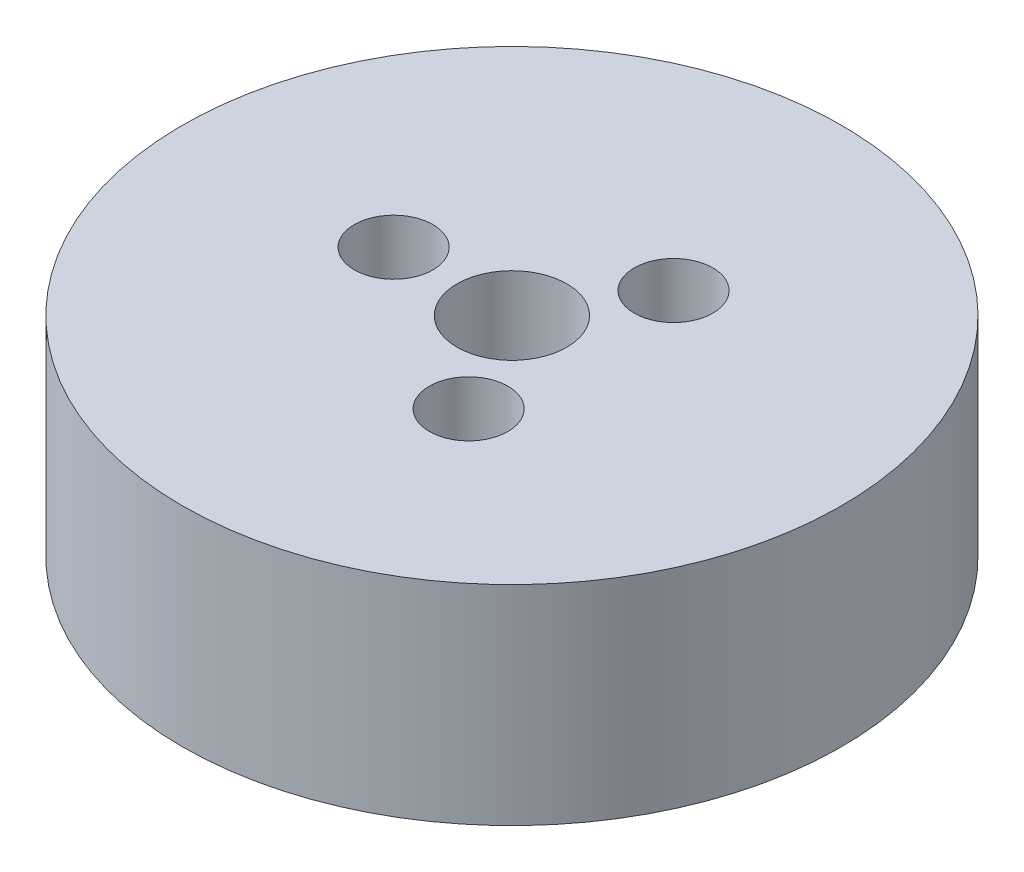
ISO-10303-21;
HEADER;
FILE_DESCRIPTION(('STEP AP214'),'2;1');
FILE_NAME('part.step','',(''),(''),'','','');
FILE_SCHEMA(('AUTOMOTIVE_DESIGN { 1 0 10303 214 1 1 1 1 }'));
ENDSEC;
DATA;
#1=APPLICATION_CONTEXT('core data for automotive mechanical design processes');
#2=APPLICATION_PROTOCOL_DEFINITION('international standard','automotive_design',2000,#1);
#3=PRODUCT_CONTEXT('',#1,'mechanical');
#4=PRODUCT('Part','Part','',(#3));
#5=PRODUCT_RELATED_PRODUCT_CATEGORY('part','',(#4));
#6=PRODUCT_DEFINITION_FORMATION('','',#4);
#7=PRODUCT_DEFINITION_CONTEXT('part definition',#1,'design');
#8=PRODUCT_DEFINITION('design','',#6,#7);
#9=PRODUCT_DEFINITION_SHAPE('','',#8);
#10=(LENGTH_UNIT() NAMED_UNIT(*) SI_UNIT(.MILLI.,.METRE.));
#11=(NAMED_UNIT(*) PLANE_ANGLE_UNIT() SI_UNIT($,.RADIAN.));
#12=(NAMED_UNIT(*) SI_UNIT($,.STERADIAN.) SOLID_ANGLE_UNIT());
#13=UNCERTAINTY_MEASURE_WITH_UNIT(LENGTH_MEASURE(1.E-05),#10,'distance_accuracy_value','');
#14=(GEOMETRIC_REPRESENTATION_CONTEXT(3) GLOBAL_UNCERTAINTY_ASSIGNED_CONTEXT((#13)) GLOBAL_UNIT_ASSIGNED_CONTEXT((#10,
#11,#12)) REPRESENTATION_CONTEXT('',''));
#15=CARTESIAN_POINT('',(0.,0.,0.));
#16=DIRECTION('',(0.,0.,1.));
#17=DIRECTION('',(1.,0.,0.));
#18=AXIS2_PLACEMENT_3D('',#15,#16,#17);
#19=CARTESIAN_POINT('',(0.,19.,0.));
#20=DIRECTION('',(0.,-1.,0.));
#21=DIRECTION('',(0.,0.,-1.));
#22=AXIS2_PLACEMENT_3D('',#19,#20,#21);
#23=CYLINDRICAL_SURFACE('',#22,30.);
#24=CARTESIAN_POINT('',(0.,19.,0.));
#25=DIRECTION('',(0.,1.,0.));
#26=DIRECTION('',(0.,0.,1.));
#27=AXIS2_PLACEMENT_3D('',#24,#25,#26);
#28=CIRCLE('',#27,30.);
#29=CARTESIAN_POINT('',(0.,19.,30.));
#30=VERTEX_POINT('',#29);
#31=EDGE_CURVE('E10',#30,#30,#28,.T.);
#32=ORIENTED_EDGE('',*,*,#31,.F.);
#33=EDGE_LOOP('',(#32));
#34=FACE_BOUND('',#33,.T.);
#35=CARTESIAN_POINT('',(0.,0.,0.));
#36=DIRECTION('',(0.,1.,0.));
#37=DIRECTION('',(0.,0.,1.));
#38=AXIS2_PLACEMENT_3D('',#35,#36,#37);
#39=CIRCLE('',#38,30.);
#40=CARTESIAN_POINT('',(0.,0.,30.));
#41=VERTEX_POINT('',#40);
#42=EDGE_CURVE('E37',#41,#41,#39,.T.);
#43=ORIENTED_EDGE('',*,*,#42,.T.);
#44=EDGE_LOOP('',(#43));
#45=FACE_BOUND('',#44,.T.);
#46=ADVANCED_FACE('F40',(#34,#45),#23,.T.);
#47=CARTESIAN_POINT('',(0.,19.,0.));
#48=DIRECTION('',(0.,1.,0.));
#49=DIRECTION('',(0.,0.,1.));
#50=AXIS2_PLACEMENT_3D('',#47,#48,#49);
#51=PLANE('',#50);
#52=CARTESIAN_POINT('',(5.38467008673534,19.,9.32652217222182));
#53=DIRECTION('',(0.,1.,0.));
#54=DIRECTION('',(0.866025403784436,0.,-0.500000000000004));
#55=AXIS2_PLACEMENT_3D('',#52,#53,#54);
#56=CIRCLE('',#55,3.57641754704199);
#57=CARTESIAN_POINT('',(8.48193853701412,19.,7.53831339870081));
#58=VERTEX_POINT('',#57);
#59=EDGE_CURVE('E70',#58,#58,#56,.T.);
#60=ORIENTED_EDGE('',*,*,#59,.F.);
#61=EDGE_LOOP('',(#60));
#62=FACE_BOUND('',#61,.T.);
#63=CARTESIAN_POINT('',(5.38467008673521,19.,-9.32652217222189));
#64=DIRECTION('',(0.,1.,0.));
#65=DIRECTION('',(-0.866025403784443,0.,-0.499999999999992));
#66=AXIS2_PLACEMENT_3D('',#63,#64,#65);
#67=CIRCLE('',#66,3.57641754704199);
#68=CARTESIAN_POINT('',(2.2874016364564,19.,-11.1147309457429));
#69=VERTEX_POINT('',#68);
#70=EDGE_CURVE('E61',#69,#69,#67,.T.);
#71=ORIENTED_EDGE('',*,*,#70,.F.);
#72=EDGE_LOOP('',(#71));
#73=FACE_BOUND('',#72,.T.);
#74=CARTESIAN_POINT('',(-10.7693401734706,19.,0.));
#75=DIRECTION('',(0.,1.,0.));
#76=DIRECTION('',(0.,0.,1.));
#77=AXIS2_PLACEMENT_3D('',#74,#75,#76);
#78=CIRCLE('',#77,3.57641754704199);
#79=CARTESIAN_POINT('',(-10.7693401734706,19.,3.57641754704199));
#80=VERTEX_POINT('',#79);
#81=EDGE_CURVE('E54',#80,#80,#78,.T.);
#82=ORIENTED_EDGE('',*,*,#81,.F.);
#83=EDGE_LOOP('',(#82));
#84=FACE_BOUND('',#83,.T.);
#85=CARTESIAN_POINT('',(0.,19.,0.));
#86=DIRECTION('',(0.,1.,0.));
#87=DIRECTION('',(0.,0.,1.));
#88=AXIS2_PLACEMENT_3D('',#85,#86,#87);
#89=CIRCLE('',#88,5.);
#90=CARTESIAN_POINT('',(0.,19.,5.));
#91=VERTEX_POINT('',#90);
#92=EDGE_CURVE('E50',#91,#91,#89,.T.);
#93=ORIENTED_EDGE('',*,*,#92,.F.);
#94=EDGE_LOOP('',(#93));
#95=FACE_BOUND('',#94,.T.);
#96=ORIENTED_EDGE('',*,*,#31,.T.);
#97=EDGE_LOOP('',(#96));
#98=FACE_BOUND('',#97,.T.);
#99=ADVANCED_FACE('F85',(#62,#73,#84,#95,#98),#51,.T.);
#100=CARTESIAN_POINT('',(0.,0.,0.));
#101=DIRECTION('',(0.,1.,0.));
#102=DIRECTION('',(0.,0.,1.));
#103=AXIS2_PLACEMENT_3D('',#100,#101,#102);
#104=PLANE('',#103);
#105=CARTESIAN_POINT('',(0.,0.,0.));
#106=DIRECTION('',(0.,1.,0.));
#107=DIRECTION('',(0.,0.,1.));
#108=AXIS2_PLACEMENT_3D('',#105,#106,#107);
#109=CIRCLE('',#108,5.);
#110=CARTESIAN_POINT('',(0.,0.,5.));
#111=VERTEX_POINT('',#110);
#112=EDGE_CURVE('E47',#111,#111,#109,.T.);
#113=ORIENTED_EDGE('',*,*,#112,.T.);
#114=EDGE_LOOP('',(#113));
#115=FACE_BOUND('',#114,.T.);
#116=ORIENTED_EDGE('',*,*,#42,.F.);
#117=EDGE_LOOP('',(#116));
#118=FACE_BOUND('',#117,.T.);
#119=ADVANCED_FACE('F84',(#115,#118),#104,.F.);
#120=CARTESIAN_POINT('',(0.,19.,0.));
#121=DIRECTION('',(0.,-1.,0.));
#122=DIRECTION('',(0.,0.,-1.));
#123=AXIS2_PLACEMENT_3D('',#120,#121,#122);
#124=CYLINDRICAL_SURFACE('',#123,5.);
#125=ORIENTED_EDGE('',*,*,#92,.T.);
#126=EDGE_LOOP('',(#125));
#127=FACE_BOUND('',#126,.T.);
#128=ORIENTED_EDGE('',*,*,#112,.F.);
#129=EDGE_LOOP('',(#128));
#130=FACE_BOUND('',#129,.T.);
#131=ADVANCED_FACE('F91',(#127,#130),#124,.F.);
#132=CARTESIAN_POINT('',(-10.7693401734706,2.39282234130104,0.));
#133=DIRECTION('',(0.,1.,0.));
#134=DIRECTION('',(0.,0.,1.));
#135=AXIS2_PLACEMENT_3D('',#132,#133,#134);
#136=CYLINDRICAL_SURFACE('',#135,3.57641754704199);
#137=CARTESIAN_POINT('',(-10.7693401734706,2.39282234130104,0.));
#138=DIRECTION('',(0.,1.,0.));
#139=DIRECTION('',(0.,0.,1.));
#140=AXIS2_PLACEMENT_3D('',#137,#138,#139);
#141=CIRCLE('',#140,3.57641754704199);
#142=CARTESIAN_POINT('',(-10.7693401734706,2.39282234130104,3.57641754704199));
#143=VERTEX_POINT('',#142);
#144=EDGE_CURVE('E55',#143,#143,#141,.T.);
#145=ORIENTED_EDGE('',*,*,#144,.F.);
#146=EDGE_LOOP('',(#145));
#147=FACE_BOUND('',#146,.T.);
#148=ORIENTED_EDGE('',*,*,#81,.T.);
#149=EDGE_LOOP('',(#148));
#150=FACE_BOUND('',#149,.T.);
#151=ADVANCED_FACE('F96',(#147,#150),#136,.F.);
#152=CARTESIAN_POINT('',(-10.7693401734706,2.39282234130104,0.));
#153=DIRECTION('',(0.,1.,0.));
#154=DIRECTION('',(0.,0.,1.));
#155=AXIS2_PLACEMENT_3D('',#152,#153,#154);
#156=PLANE('',#155);
#157=ORIENTED_EDGE('',*,*,#144,.T.);
#158=EDGE_LOOP('',(#157));
#159=FACE_BOUND('',#158,.T.);
#160=ADVANCED_FACE('F127',(#159),#156,.T.);
#161=CARTESIAN_POINT('',(5.38467008673521,2.39282234130104,-9.32652217222189));
#162=DIRECTION('',(0.,1.,0.));
#163=DIRECTION('',(0.,0.,1.));
#164=AXIS2_PLACEMENT_3D('',#161,#162,#163);
#165=CYLINDRICAL_SURFACE('',#164,3.57641754704199);
#166=CARTESIAN_POINT('',(5.38467008673521,2.39282234130104,-9.32652217222189));
#167=DIRECTION('',(0.,1.,0.));
#168=DIRECTION('',(-0.866025403784443,0.,-0.499999999999992));
#169=AXIS2_PLACEMENT_3D('',#166,#167,#168);
#170=CIRCLE('',#169,3.57641754704199);
#171=CARTESIAN_POINT('',(2.2874016364564,2.39282234130104,-11.1147309457429));
#172=VERTEX_POINT('',#171);
#173=EDGE_CURVE('E63',#172,#172,#170,.T.);
#174=ORIENTED_EDGE('',*,*,#173,.F.);
#175=EDGE_LOOP('',(#174));
#176=FACE_BOUND('',#175,.T.);
#177=ORIENTED_EDGE('',*,*,#70,.T.);
#178=EDGE_LOOP('',(#177));
#179=FACE_BOUND('',#178,.T.);
#180=ADVANCED_FACE('F133',(#176,#179),#165,.F.);
#181=CARTESIAN_POINT('',(5.38467008673521,2.39282234130104,-9.32652217222189));
#182=DIRECTION('',(0.,1.,0.));
#183=DIRECTION('',(-0.866025403784443,0.,-0.499999999999992));
#184=AXIS2_PLACEMENT_3D('',#181,#182,#183);
#185=PLANE('',#184);
#186=ORIENTED_EDGE('',*,*,#173,.T.);
#187=EDGE_LOOP('',(#186));
#188=FACE_BOUND('',#187,.T.);
#189=ADVANCED_FACE('F77',(#188),#185,.T.);
#190=CARTESIAN_POINT('',(5.38467008673534,2.39282234130104,9.32652217222182));
#191=DIRECTION('',(0.,1.,0.));
#192=DIRECTION('',(0.,0.,1.));
#193=AXIS2_PLACEMENT_3D('',#190,#191,#192);
#194=CYLINDRICAL_SURFACE('',#193,3.57641754704199);
#195=CARTESIAN_POINT('',(5.38467008673534,2.39282234130104,9.32652217222182));
#196=DIRECTION('',(0.,1.,0.));
#197=DIRECTION('',(0.866025403784436,0.,-0.500000000000004));
#198=AXIS2_PLACEMENT_3D('',#195,#196,#197);
#199=CIRCLE('',#198,3.57641754704199);
#200=CARTESIAN_POINT('',(8.48193853701412,2.39282234130104,7.53831339870081));
#201=VERTEX_POINT('',#200);
#202=EDGE_CURVE('E59',#201,#201,#199,.T.);
#203=ORIENTED_EDGE('',*,*,#202,.F.);
#204=EDGE_LOOP('',(#203));
#205=FACE_BOUND('',#204,.T.);
#206=ORIENTED_EDGE('',*,*,#59,.T.);
#207=EDGE_LOOP('',(#206));
#208=FACE_BOUND('',#207,.T.);
#209=ADVANCED_FACE('F73',(#205,#208),#194,.F.);
#210=CARTESIAN_POINT('',(5.38467008673534,2.39282234130104,9.32652217222182));
#211=DIRECTION('',(0.,1.,0.));
#212=DIRECTION('',(0.866025403784436,0.,-0.500000000000004));
#213=AXIS2_PLACEMENT_3D('',#210,#211,#212);
#214=PLANE('',#213);
#215=ORIENTED_EDGE('',*,*,#202,.T.);
#216=EDGE_LOOP('',(#215));
#217=FACE_BOUND('',#216,.T.);
#218=ADVANCED_FACE('F71',(#217),#214,.T.);
#219=CLOSED_SHELL('',(#46,#99,#119,#131,#151,#160,#180,#189,#209,#218));
#220=MANIFOLD_SOLID_BREP('B2',#219);
#221=ADVANCED_BREP_SHAPE_REPRESENTATION('',(#18,#220),#14);
#222=SHAPE_DEFINITION_REPRESENTATION(#9,#221);
ENDSEC;
END-ISO-10303-21;
